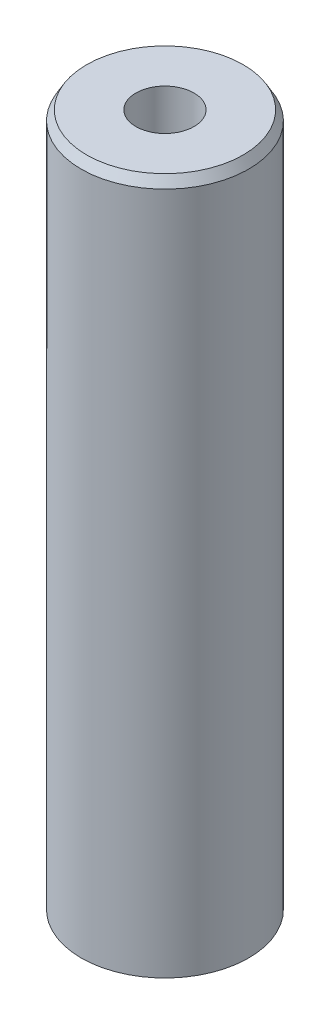
ISO-10303-21;
HEADER;
FILE_DESCRIPTION(('STEP AP214'),'2;1');
FILE_NAME('part.step','',(''),(''),'','','');
FILE_SCHEMA(('AUTOMOTIVE_DESIGN { 1 0 10303 214 1 1 1 1 }'));
ENDSEC;
DATA;
#1=APPLICATION_CONTEXT('core data for automotive mechanical design processes');
#2=APPLICATION_PROTOCOL_DEFINITION('international standard','automotive_design',2000,#1);
#3=PRODUCT_CONTEXT('',#1,'mechanical');
#4=PRODUCT('Part','Part','',(#3));
#5=PRODUCT_RELATED_PRODUCT_CATEGORY('part','',(#4));
#6=PRODUCT_DEFINITION_FORMATION('','',#4);
#7=PRODUCT_DEFINITION_CONTEXT('part definition',#1,'design');
#8=PRODUCT_DEFINITION('design','',#6,#7);
#9=PRODUCT_DEFINITION_SHAPE('','',#8);
#10=(LENGTH_UNIT() NAMED_UNIT(*) SI_UNIT(.MILLI.,.METRE.));
#11=(NAMED_UNIT(*) PLANE_ANGLE_UNIT() SI_UNIT($,.RADIAN.));
#12=(NAMED_UNIT(*) SI_UNIT($,.STERADIAN.) SOLID_ANGLE_UNIT());
#13=UNCERTAINTY_MEASURE_WITH_UNIT(LENGTH_MEASURE(1.E-05),#10,'distance_accuracy_value','');
#14=(GEOMETRIC_REPRESENTATION_CONTEXT(3) GLOBAL_UNCERTAINTY_ASSIGNED_CONTEXT((#13)) GLOBAL_UNIT_ASSIGNED_CONTEXT((#10,
#11,#12)) REPRESENTATION_CONTEXT('',''));
#15=CARTESIAN_POINT('',(0.,0.,0.));
#16=DIRECTION('',(0.,0.,1.));
#17=DIRECTION('',(1.,0.,0.));
#18=AXIS2_PLACEMENT_3D('',#15,#16,#17);
#19=CARTESIAN_POINT('',(0.,166.70391922733,0.));
#20=DIRECTION('',(0.,-1.,0.));
#21=DIRECTION('',(0.,0.,-1.));
#22=AXIS2_PLACEMENT_3D('',#19,#20,#21);
#23=CYLINDRICAL_SURFACE('',#22,20.);
#24=CARTESIAN_POINT('',(0.,164.43199122468,0.));
#25=DIRECTION('',(0.,1.,0.));
#26=DIRECTION('',(0.,0.,1.));
#27=AXIS2_PLACEMENT_3D('',#24,#25,#26);
#28=CIRCLE('',#27,20.);
#29=CARTESIAN_POINT('',(0.,164.43199122468,20.));
#30=VERTEX_POINT('',#29);
#31=EDGE_CURVE('E50',#30,#30,#28,.F.);
#32=ORIENTED_EDGE('',*,*,#31,.T.);
#33=EDGE_LOOP('',(#32));
#34=FACE_BOUND('',#33,.T.);
#35=CARTESIAN_POINT('',(0.,1.31169824390978,0.));
#36=DIRECTION('',(0.,1.,0.));
#37=DIRECTION('',(0.,0.,1.));
#38=AXIS2_PLACEMENT_3D('',#35,#36,#37);
#39=CIRCLE('',#38,20.);
#40=CARTESIAN_POINT('',(0.,1.31169824390978,20.));
#41=VERTEX_POINT('',#40);
#42=EDGE_CURVE('E51',#41,#41,#39,.T.);
#43=ORIENTED_EDGE('',*,*,#42,.T.);
#44=EDGE_LOOP('',(#43));
#45=FACE_BOUND('',#44,.T.);
#46=ADVANCED_FACE('F39',(#34,#45),#23,.T.);
#47=CARTESIAN_POINT('',(0.,166.70391922733,0.));
#48=DIRECTION('',(0.,1.,0.));
#49=DIRECTION('',(0.,0.,1.));
#50=AXIS2_PLACEMENT_3D('',#47,#48,#49);
#51=PLANE('',#50);
#52=CARTESIAN_POINT('',(0.,166.70391922733,0.));
#53=DIRECTION('',(0.,1.,0.));
#54=DIRECTION('',(0.,0.,1.));
#55=AXIS2_PLACEMENT_3D('',#52,#53,#54);
#56=CIRCLE('',#55,18.6883017560902);
#57=CARTESIAN_POINT('',(0.,166.70391922733,18.6883017560902));
#58=VERTEX_POINT('',#57);
#59=EDGE_CURVE('E54',#58,#58,#56,.T.);
#60=ORIENTED_EDGE('',*,*,#59,.T.);
#61=EDGE_LOOP('',(#60));
#62=FACE_BOUND('',#61,.T.);
#63=CARTESIAN_POINT('',(0.,166.70391922733,0.));
#64=DIRECTION('',(0.,1.,0.));
#65=DIRECTION('',(0.,0.,1.));
#66=AXIS2_PLACEMENT_3D('',#63,#64,#65);
#67=CIRCLE('',#66,6.945348901377);
#68=CARTESIAN_POINT('',(0.,166.70391922733,6.945348901377));
#69=VERTEX_POINT('',#68);
#70=EDGE_CURVE('E58',#69,#69,#67,.T.);
#71=ORIENTED_EDGE('',*,*,#70,.F.);
#72=EDGE_LOOP('',(#71));
#73=FACE_BOUND('',#72,.T.);
#74=ADVANCED_FACE('F69',(#62,#73),#51,.T.);
#75=CARTESIAN_POINT('',(0.,0.,0.));
#76=DIRECTION('',(0.,1.,0.));
#77=DIRECTION('',(0.,0.,1.));
#78=AXIS2_PLACEMENT_3D('',#75,#76,#77);
#79=PLANE('',#78);
#80=CARTESIAN_POINT('',(0.,0.,0.));
#81=DIRECTION('',(0.,1.,0.));
#82=DIRECTION('',(0.,0.,1.));
#83=AXIS2_PLACEMENT_3D('',#80,#81,#82);
#84=CIRCLE('',#83,17.7280719973494);
#85=CARTESIAN_POINT('',(0.,0.,17.7280719973494));
#86=VERTEX_POINT('',#85);
#87=EDGE_CURVE('E10',#86,#86,#84,.F.);
#88=ORIENTED_EDGE('',*,*,#87,.T.);
#89=EDGE_LOOP('',(#88));
#90=FACE_BOUND('',#89,.T.);
#91=CARTESIAN_POINT('',(0.,0.,0.));
#92=DIRECTION('',(0.,1.,0.));
#93=DIRECTION('',(0.,0.,1.));
#94=AXIS2_PLACEMENT_3D('',#91,#92,#93);
#95=CIRCLE('',#94,6.945348901377);
#96=CARTESIAN_POINT('',(0.,0.,6.945348901377));
#97=VERTEX_POINT('',#96);
#98=EDGE_CURVE('E63',#97,#97,#95,.T.);
#99=ORIENTED_EDGE('',*,*,#98,.T.);
#100=EDGE_LOOP('',(#99));
#101=FACE_BOUND('',#100,.T.);
#102=ADVANCED_FACE('F75',(#90,#101),#79,.F.);
#103=CARTESIAN_POINT('',(0.,166.70391922733,0.));
#104=DIRECTION('',(0.,-1.,0.));
#105=DIRECTION('',(0.,0.,-1.));
#106=AXIS2_PLACEMENT_3D('',#103,#104,#105);
#107=CYLINDRICAL_SURFACE('',#106,6.945348901377);
#108=ORIENTED_EDGE('',*,*,#70,.T.);
#109=EDGE_LOOP('',(#108));
#110=FACE_BOUND('',#109,.T.);
#111=ORIENTED_EDGE('',*,*,#98,.F.);
#112=EDGE_LOOP('',(#111));
#113=FACE_BOUND('',#112,.T.);
#114=ADVANCED_FACE('F70',(#110,#113),#107,.F.);
#115=CARTESIAN_POINT('',(0.,166.70391922733,0.));
#116=DIRECTION('',(0.,-1.,0.));
#117=DIRECTION('',(0.,0.,-1.));
#118=AXIS2_PLACEMENT_3D('',#115,#116,#117);
#119=CONICAL_SURFACE('',#118,18.6883017560902,0.523598775598294);
#120=ORIENTED_EDGE('',*,*,#31,.F.);
#121=EDGE_LOOP('',(#120));
#122=FACE_BOUND('',#121,.T.);
#123=ORIENTED_EDGE('',*,*,#59,.F.);
#124=EDGE_LOOP('',(#123));
#125=FACE_BOUND('',#124,.T.);
#126=ADVANCED_FACE('F81',(#122,#125),#119,.T.);
#127=CARTESIAN_POINT('',(0.,1.31169824390978,0.));
#128=DIRECTION('',(0.,1.,0.));
#129=DIRECTION('',(0.,0.,1.));
#130=AXIS2_PLACEMENT_3D('',#127,#128,#129);
#131=CONICAL_SURFACE('',#130,20.,1.0471975511966);
#132=ORIENTED_EDGE('',*,*,#87,.F.);
#133=EDGE_LOOP('',(#132));
#134=FACE_BOUND('',#133,.T.);
#135=ORIENTED_EDGE('',*,*,#42,.F.);
#136=EDGE_LOOP('',(#135));
#137=FACE_BOUND('',#136,.T.);
#138=ADVANCED_FACE('F45',(#134,#137),#131,.T.);
#139=CLOSED_SHELL('',(#46,#74,#102,#114,#126,#138));
#140=MANIFOLD_SOLID_BREP('B2',#139);
#141=ADVANCED_BREP_SHAPE_REPRESENTATION('',(#18,#140),#14);
#142=SHAPE_DEFINITION_REPRESENTATION(#9,#141);
ENDSEC;
END-ISO-10303-21;
